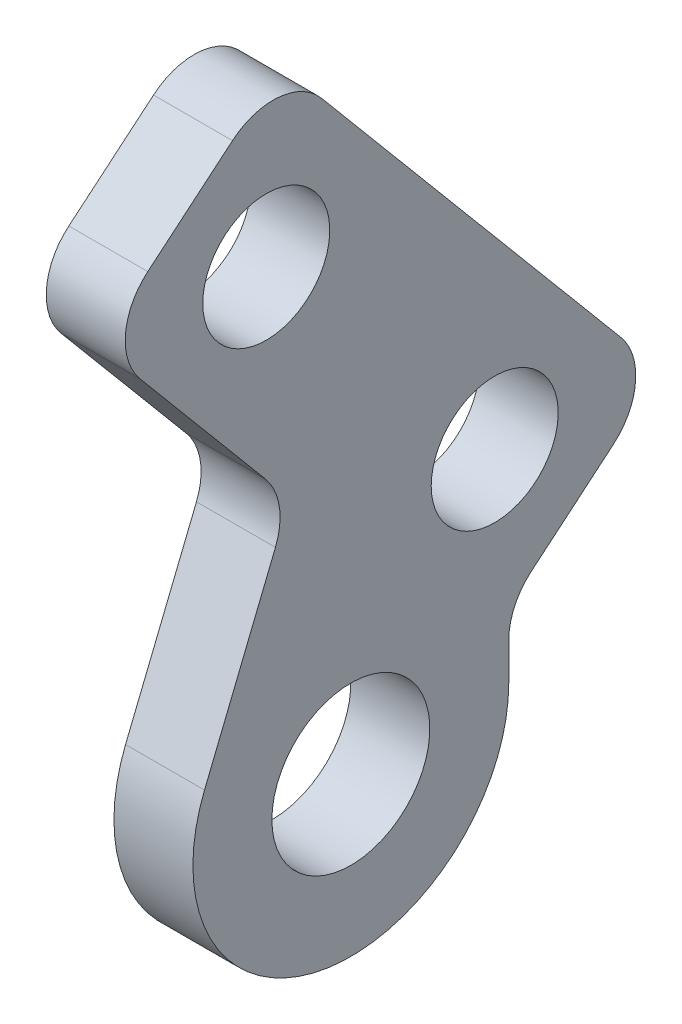
ISO-10303-21;
HEADER;
FILE_DESCRIPTION(('STEP AP214'),'2;1');
FILE_NAME('part.step','',(''),(''),'','','');
FILE_SCHEMA(('AUTOMOTIVE_DESIGN { 1 0 10303 214 1 1 1 1 }'));
ENDSEC;
DATA;
#1=APPLICATION_CONTEXT('core data for automotive mechanical design processes');
#2=APPLICATION_PROTOCOL_DEFINITION('international standard','automotive_design',2000,#1);
#3=PRODUCT_CONTEXT('',#1,'mechanical');
#4=PRODUCT('Part','Part','',(#3));
#5=PRODUCT_RELATED_PRODUCT_CATEGORY('part','',(#4));
#6=PRODUCT_DEFINITION_FORMATION('','',#4);
#7=PRODUCT_DEFINITION_CONTEXT('part definition',#1,'design');
#8=PRODUCT_DEFINITION('design','',#6,#7);
#9=PRODUCT_DEFINITION_SHAPE('','',#8);
#10=(LENGTH_UNIT() NAMED_UNIT(*) SI_UNIT(.MILLI.,.METRE.));
#11=(NAMED_UNIT(*) PLANE_ANGLE_UNIT() SI_UNIT($,.RADIAN.));
#12=(NAMED_UNIT(*) SI_UNIT($,.STERADIAN.) SOLID_ANGLE_UNIT());
#13=UNCERTAINTY_MEASURE_WITH_UNIT(LENGTH_MEASURE(1.E-05),#10,'distance_accuracy_value','');
#14=(GEOMETRIC_REPRESENTATION_CONTEXT(3) GLOBAL_UNCERTAINTY_ASSIGNED_CONTEXT((#13)) GLOBAL_UNIT_ASSIGNED_CONTEXT((#10,
#11,#12)) REPRESENTATION_CONTEXT('',''));
#15=CARTESIAN_POINT('',(0.,0.,0.));
#16=DIRECTION('',(0.,0.,1.));
#17=DIRECTION('',(1.,0.,0.));
#18=AXIS2_PLACEMENT_3D('',#15,#16,#17);
#19=CARTESIAN_POINT('',(-1.5875,9.52500000000001,-176.47164647412));
#20=DIRECTION('',(-1.,0.,0.));
#21=DIRECTION('',(0.,0.,1.));
#22=AXIS2_PLACEMENT_3D('',#19,#20,#21);
#23=PLANE('',#22);
#24=CARTESIAN_POINT('',(-1.58750000000001,9.52500000000001,-176.47164647412));
#25=DIRECTION('',(-1.,0.,0.));
#26=DIRECTION('',(0.,0.,1.));
#27=AXIS2_PLACEMENT_3D('',#24,#25,#26);
#28=CIRCLE('',#27,3.175);
#29=CARTESIAN_POINT('',(-1.58750000000001,9.52500000000001,-173.29664647412));
#30=VERTEX_POINT('',#29);
#31=EDGE_CURVE('E163',#30,#30,#28,.T.);
#32=ORIENTED_EDGE('',*,*,#31,.F.);
#33=EDGE_LOOP('',(#32));
#34=FACE_BOUND('',#33,.T.);
#35=CARTESIAN_POINT('',(-1.5875,28.8892429303716,-173.071588618471));
#36=DIRECTION('',(-1.,0.,0.));
#37=DIRECTION('',(0.,0.,1.));
#38=AXIS2_PLACEMENT_3D('',#35,#36,#37);
#39=CIRCLE('',#38,2.55269999999998);
#40=CARTESIAN_POINT('',(-1.5875,28.8892429303716,-170.518888618471));
#41=VERTEX_POINT('',#40);
#42=EDGE_CURVE('E223',#41,#41,#39,.T.);
#43=ORIENTED_EDGE('',*,*,#42,.F.);
#44=EDGE_LOOP('',(#43));
#45=FACE_BOUND('',#44,.T.);
#46=DIRECTION('',(0.,0.766044443118974,0.642787609686545));
#47=VECTOR('',#46,1.);
#48=CARTESIAN_POINT('',(-1.5875,81.5666029531743,-122.653033036499));
#49=LINE('',#48,#47);
#50=CARTESIAN_POINT('',(-1.5875,21.5268788651857,-173.032343374717));
#51=VERTEX_POINT('',#50);
#52=CARTESIAN_POINT('',(-1.5875,27.5305007140713,-167.994706495589));
#53=VERTEX_POINT('',#52);
#54=EDGE_CURVE('E138',#51,#53,#49,.T.);
#55=ORIENTED_EDGE('',*,*,#54,.T.);
#56=CARTESIAN_POINT('',(-1.5875,29.1631812426751,-169.940459381111));
#57=DIRECTION('',(-1.,0.,0.));
#58=DIRECTION('',(0.,0.,1.));
#59=AXIS2_PLACEMENT_3D('',#56,#57,#58);
#60=CIRCLE('',#59,2.54);
#61=CARTESIAN_POINT('',(-1.5875,31.1089341281973,-168.307778852507));
#62=VERTEX_POINT('',#61);
#63=EDGE_CURVE('E183',#53,#62,#60,.T.);
#64=ORIENTED_EDGE('',*,*,#63,.T.);
#65=DIRECTION('',(0.,0.642787609686545,-0.766044443118973));
#66=VECTOR('',#65,1.);
#67=CARTESIAN_POINT('',(-1.5875,30.4596506464192,-167.533992930486));
#68=LINE('',#67,#66);
#69=CARTESIAN_POINT('',(-1.5875,33.966125053254,-171.712846402171));
#70=VERTEX_POINT('',#69);
#71=EDGE_CURVE('E244',#62,#70,#68,.T.);
#72=ORIENTED_EDGE('',*,*,#71,.T.);
#73=CARTESIAN_POINT('',(-1.5875,32.0203721677318,-173.345526930775));
#74=DIRECTION('',(-1.,0.,0.));
#75=DIRECTION('',(0.,0.,1.));
#76=AXIS2_PLACEMENT_3D('',#73,#74,#75);
#77=CIRCLE('',#76,2.54);
#78=CARTESIAN_POINT('',(-1.5875,33.6530526963356,-175.291279816297));
#79=VERTEX_POINT('',#78);
#80=EDGE_CURVE('E181',#70,#79,#77,.T.);
#81=ORIENTED_EDGE('',*,*,#80,.T.);
#82=DIRECTION('',(0.,-0.766044443118974,-0.642787609686544));
#83=VECTOR('',#82,1.);
#84=CARTESIAN_POINT('',(-1.5875,87.6891549354387,-129.949606357207));
#85=LINE('',#84,#83);
#86=CARTESIAN_POINT('',(-1.5875,19.3031251656094,-187.33229871475));
#87=VERTEX_POINT('',#86);
#88=EDGE_CURVE('E217',#79,#87,#85,.T.);
#89=ORIENTED_EDGE('',*,*,#88,.T.);
#90=CARTESIAN_POINT('',(-1.5875,17.6704446370056,-185.386545829228));
#91=DIRECTION('',(-1.,0.,0.));
#92=DIRECTION('',(0.,0.,1.));
#93=AXIS2_PLACEMENT_3D('',#90,#91,#92);
#94=CIRCLE('',#93,2.54);
#95=CARTESIAN_POINT('',(-1.5875,15.7246917514834,-187.019226357832));
#96=VERTEX_POINT('',#95);
#97=EDGE_CURVE('E179',#87,#96,#94,.T.);
#98=ORIENTED_EDGE('',*,*,#97,.T.);
#99=DIRECTION('',(0.,-0.642787609686544,0.766044443118974));
#100=VECTOR('',#99,1.);
#101=CARTESIAN_POINT('',(-1.5875,12.2182173446486,-182.840372886147));
#102=LINE('',#101,#100);
#103=CARTESIAN_POINT('',(-1.5875,12.9638354530325,-183.728965945517));
#104=VERTEX_POINT('',#103);
#105=EDGE_CURVE('E215',#96,#104,#102,.T.);
#106=ORIENTED_EDGE('',*,*,#105,.T.);
#107=CARTESIAN_POINT('',(-1.5875,11.0180825675103,-185.36164647412));
#108=DIRECTION('',(-1.,0.,0.));
#109=DIRECTION('',(0.,0.,1.));
#110=AXIS2_PLACEMENT_3D('',#107,#108,#109);
#111=CIRCLE('',#110,2.54);
#112=CARTESIAN_POINT('',(-1.5875,11.0180825675103,-182.82164647412));
#113=VERTEX_POINT('',#112);
#114=EDGE_CURVE('E11',#104,#113,#111,.F.);
#115=ORIENTED_EDGE('',*,*,#114,.T.);
#116=DIRECTION('',(0.,-1.,0.));
#117=VECTOR('',#116,1.);
#118=CARTESIAN_POINT('',(-1.5875,82.55,-182.82164647412));
#119=LINE('',#118,#117);
#120=CARTESIAN_POINT('',(-1.5875,9.52500000000001,-182.82164647412));
#121=VERTEX_POINT('',#120);
#122=EDGE_CURVE('E144',#113,#121,#119,.T.);
#123=ORIENTED_EDGE('',*,*,#122,.T.);
#124=CARTESIAN_POINT('',(-1.5875,9.52500000000001,-176.47164647412));
#125=DIRECTION('',(-1.,0.,0.));
#126=DIRECTION('',(0.,0.,1.));
#127=AXIS2_PLACEMENT_3D('',#124,#125,#126);
#128=CIRCLE('',#127,6.34999999999999);
#129=CARTESIAN_POINT('',(-1.5875,11.9135952794059,-170.588015572101));
#130=VERTEX_POINT('',#129);
#131=EDGE_CURVE('E139',#121,#130,#128,.T.);
#132=ORIENTED_EDGE('',*,*,#131,.T.);
#133=DIRECTION('',(0.,0.926556047562137,-0.376156736914323));
#134=VECTOR('',#133,1.);
#135=CARTESIAN_POINT('',(-1.5875,56.2570524500952,-188.590261843887));
#136=LINE('',#135,#134);
#137=CARTESIAN_POINT('',(-1.5875,18.9387602248195,-173.440042850002));
#138=VERTEX_POINT('',#137);
#139=EDGE_CURVE('E128',#130,#138,#136,.T.);
#140=ORIENTED_EDGE('',*,*,#139,.T.);
#141=CARTESIAN_POINT('',(-1.5875,19.8941983365819,-171.086590489194));
#142=DIRECTION('',(-1.,0.,0.));
#143=DIRECTION('',(0.,0.,1.));
#144=AXIS2_PLACEMENT_3D('',#141,#142,#143);
#145=CIRCLE('',#144,2.54);
#146=EDGE_CURVE('E199',#138,#51,#145,.F.);
#147=ORIENTED_EDGE('',*,*,#146,.T.);
#148=EDGE_LOOP('',(#55,#64,#72,#81,#89,#98,#106,#115,#123,#132,#140,#147));
#149=FACE_BOUND('',#148,.T.);
#150=CARTESIAN_POINT('',(-1.5875,17.9443829493092,-182.255416591868));
#151=DIRECTION('',(-1.,0.,0.));
#152=DIRECTION('',(0.,0.,1.));
#153=AXIS2_PLACEMENT_3D('',#150,#151,#152);
#154=CIRCLE('',#153,2.55270000000004);
#155=CARTESIAN_POINT('',(-1.5875,17.9443829493092,-179.702716591868));
#156=VERTEX_POINT('',#155);
#157=EDGE_CURVE('E251',#156,#156,#154,.T.);
#158=ORIENTED_EDGE('',*,*,#157,.F.);
#159=EDGE_LOOP('',(#158));
#160=FACE_BOUND('',#159,.T.);
#161=ADVANCED_FACE('F39',(#34,#45,#149,#160),#23,.T.);
#162=CARTESIAN_POINT('',(1.5875,9.52500000000001,-176.47164647412));
#163=DIRECTION('',(-1.,0.,0.));
#164=DIRECTION('',(0.,0.,1.));
#165=AXIS2_PLACEMENT_3D('',#162,#163,#164);
#166=PLANE('',#165);
#167=CARTESIAN_POINT('',(1.5875,9.52500000000001,-176.47164647412));
#168=DIRECTION('',(-1.,0.,0.));
#169=DIRECTION('',(0.,0.,1.));
#170=AXIS2_PLACEMENT_3D('',#167,#168,#169);
#171=CIRCLE('',#170,3.175);
#172=CARTESIAN_POINT('',(1.5875,9.52500000000001,-173.29664647412));
#173=VERTEX_POINT('',#172);
#174=EDGE_CURVE('E161',#173,#173,#171,.T.);
#175=ORIENTED_EDGE('',*,*,#174,.T.);
#176=EDGE_LOOP('',(#175));
#177=FACE_BOUND('',#176,.T.);
#178=DIRECTION('',(0.,0.642787609686545,-0.766044443118973));
#179=VECTOR('',#178,1.);
#180=CARTESIAN_POINT('',(1.5875,30.4596506464192,-167.533992930486));
#181=LINE('',#180,#179);
#182=CARTESIAN_POINT('',(1.5875,31.1089341281973,-168.307778852507));
#183=VERTEX_POINT('',#182);
#184=CARTESIAN_POINT('',(1.5875,33.966125053254,-171.712846402171));
#185=VERTEX_POINT('',#184);
#186=EDGE_CURVE('E228',#183,#185,#181,.T.);
#187=ORIENTED_EDGE('',*,*,#186,.F.);
#188=CARTESIAN_POINT('',(1.5875,29.1631812426751,-169.940459381111));
#189=DIRECTION('',(-1.,0.,0.));
#190=DIRECTION('',(0.,0.,1.));
#191=AXIS2_PLACEMENT_3D('',#188,#189,#190);
#192=CIRCLE('',#191,2.54);
#193=CARTESIAN_POINT('',(1.5875,27.5305007140713,-167.994706495589));
#194=VERTEX_POINT('',#193);
#195=EDGE_CURVE('E177',#183,#194,#192,.F.);
#196=ORIENTED_EDGE('',*,*,#195,.T.);
#197=DIRECTION('',(0.,0.766044443118974,0.642787609686545));
#198=VECTOR('',#197,1.);
#199=CARTESIAN_POINT('',(1.5875,81.5666029531743,-122.653033036499));
#200=LINE('',#199,#198);
#201=CARTESIAN_POINT('',(1.5875,21.5268788651857,-173.032343374717));
#202=VERTEX_POINT('',#201);
#203=EDGE_CURVE('E225',#202,#194,#200,.T.);
#204=ORIENTED_EDGE('',*,*,#203,.F.);
#205=CARTESIAN_POINT('',(1.5875,19.8941983365819,-171.086590489194));
#206=DIRECTION('',(-1.,0.,0.));
#207=DIRECTION('',(0.,0.,1.));
#208=AXIS2_PLACEMENT_3D('',#205,#206,#207);
#209=CIRCLE('',#208,2.54);
#210=CARTESIAN_POINT('',(1.5875,18.9387602248195,-173.440042850002));
#211=VERTEX_POINT('',#210);
#212=EDGE_CURVE('E197',#202,#211,#209,.T.);
#213=ORIENTED_EDGE('',*,*,#212,.T.);
#214=DIRECTION('',(0.,0.926556047562137,-0.376156736914323));
#215=VECTOR('',#214,1.);
#216=CARTESIAN_POINT('',(1.5875,56.2570524500952,-188.590261843887));
#217=LINE('',#216,#215);
#218=CARTESIAN_POINT('',(1.5875,11.9135952794059,-170.588015572101));
#219=VERTEX_POINT('',#218);
#220=EDGE_CURVE('E222',#219,#211,#217,.T.);
#221=ORIENTED_EDGE('',*,*,#220,.F.);
#222=CARTESIAN_POINT('',(1.5875,9.52500000000001,-176.47164647412));
#223=DIRECTION('',(-1.,0.,0.));
#224=DIRECTION('',(0.,0.,1.));
#225=AXIS2_PLACEMENT_3D('',#222,#223,#224);
#226=CIRCLE('',#225,6.34999999999999);
#227=CARTESIAN_POINT('',(1.5875,9.52500000000001,-182.82164647412));
#228=VERTEX_POINT('',#227);
#229=EDGE_CURVE('E152',#228,#219,#226,.T.);
#230=ORIENTED_EDGE('',*,*,#229,.F.);
#231=DIRECTION('',(0.,-1.,0.));
#232=VECTOR('',#231,1.);
#233=CARTESIAN_POINT('',(1.5875,82.55,-182.82164647412));
#234=LINE('',#233,#232);
#235=CARTESIAN_POINT('',(1.5875,11.0180825675103,-182.82164647412));
#236=VERTEX_POINT('',#235);
#237=EDGE_CURVE('E148',#236,#228,#234,.T.);
#238=ORIENTED_EDGE('',*,*,#237,.F.);
#239=CARTESIAN_POINT('',(1.5875,11.0180825675103,-185.36164647412));
#240=DIRECTION('',(-1.,0.,0.));
#241=DIRECTION('',(0.,0.,1.));
#242=AXIS2_PLACEMENT_3D('',#239,#240,#241);
#243=CIRCLE('',#242,2.54);
#244=CARTESIAN_POINT('',(1.5875,12.9638354530325,-183.728965945517));
#245=VERTEX_POINT('',#244);
#246=EDGE_CURVE('E47',#236,#245,#243,.T.);
#247=ORIENTED_EDGE('',*,*,#246,.T.);
#248=DIRECTION('',(0.,-0.642787609686544,0.766044443118974));
#249=VECTOR('',#248,1.);
#250=CARTESIAN_POINT('',(1.5875,12.2182173446486,-182.840372886147));
#251=LINE('',#250,#249);
#252=CARTESIAN_POINT('',(1.5875,15.7246917514834,-187.019226357832));
#253=VERTEX_POINT('',#252);
#254=EDGE_CURVE('E206',#253,#245,#251,.T.);
#255=ORIENTED_EDGE('',*,*,#254,.F.);
#256=CARTESIAN_POINT('',(1.5875,17.6704446370056,-185.386545829228));
#257=DIRECTION('',(-1.,0.,0.));
#258=DIRECTION('',(0.,0.,1.));
#259=AXIS2_PLACEMENT_3D('',#256,#257,#258);
#260=CIRCLE('',#259,2.54);
#261=CARTESIAN_POINT('',(1.5875,19.3031251656094,-187.33229871475));
#262=VERTEX_POINT('',#261);
#263=EDGE_CURVE('E173',#253,#262,#260,.F.);
#264=ORIENTED_EDGE('',*,*,#263,.T.);
#265=DIRECTION('',(0.,-0.766044443118974,-0.642787609686544));
#266=VECTOR('',#265,1.);
#267=CARTESIAN_POINT('',(1.5875,87.6891549354387,-129.949606357207));
#268=LINE('',#267,#266);
#269=CARTESIAN_POINT('',(1.5875,33.6530526963356,-175.291279816297));
#270=VERTEX_POINT('',#269);
#271=EDGE_CURVE('E211',#270,#262,#268,.T.);
#272=ORIENTED_EDGE('',*,*,#271,.F.);
#273=CARTESIAN_POINT('',(1.5875,32.0203721677318,-173.345526930775));
#274=DIRECTION('',(-1.,0.,0.));
#275=DIRECTION('',(0.,0.,1.));
#276=AXIS2_PLACEMENT_3D('',#273,#274,#275);
#277=CIRCLE('',#276,2.54);
#278=EDGE_CURVE('E175',#270,#185,#277,.F.);
#279=ORIENTED_EDGE('',*,*,#278,.T.);
#280=EDGE_LOOP('',(#187,#196,#204,#213,#221,#230,#238,#247,#255,#264,#272,#279));
#281=FACE_BOUND('',#280,.T.);
#282=CARTESIAN_POINT('',(1.5875,28.8892429303716,-173.071588618471));
#283=DIRECTION('',(-1.,0.,0.));
#284=DIRECTION('',(0.,0.,1.));
#285=AXIS2_PLACEMENT_3D('',#282,#283,#284);
#286=CIRCLE('',#285,2.55269999999998);
#287=CARTESIAN_POINT('',(1.5875,28.8892429303716,-170.518888618471));
#288=VERTEX_POINT('',#287);
#289=EDGE_CURVE('E248',#288,#288,#286,.T.);
#290=ORIENTED_EDGE('',*,*,#289,.T.);
#291=EDGE_LOOP('',(#290));
#292=FACE_BOUND('',#291,.T.);
#293=CARTESIAN_POINT('',(1.5875,17.9443829493092,-182.255416591868));
#294=DIRECTION('',(-1.,0.,0.));
#295=DIRECTION('',(0.,0.,1.));
#296=AXIS2_PLACEMENT_3D('',#293,#294,#295);
#297=CIRCLE('',#296,2.55270000000004);
#298=CARTESIAN_POINT('',(1.5875,17.9443829493092,-179.702716591868));
#299=VERTEX_POINT('',#298);
#300=EDGE_CURVE('E254',#299,#299,#297,.T.);
#301=ORIENTED_EDGE('',*,*,#300,.T.);
#302=EDGE_LOOP('',(#301));
#303=FACE_BOUND('',#302,.T.);
#304=ADVANCED_FACE('F204',(#177,#281,#292,#303),#166,.F.);
#305=CARTESIAN_POINT('',(-1.5875,9.52500000000001,-176.47164647412));
#306=DIRECTION('',(1.,0.,0.));
#307=DIRECTION('',(0.,0.,-1.));
#308=AXIS2_PLACEMENT_3D('',#305,#306,#307);
#309=CYLINDRICAL_SURFACE('',#308,6.34999999999999);
#310=ORIENTED_EDGE('',*,*,#229,.T.);
#311=DIRECTION('',(1.,0.,0.));
#312=VECTOR('',#311,1.);
#313=CARTESIAN_POINT('',(-1.5875,11.9135952794059,-170.588015572101));
#314=LINE('',#313,#312);
#315=EDGE_CURVE('E133',#130,#219,#314,.T.);
#316=ORIENTED_EDGE('',*,*,#315,.F.);
#317=ORIENTED_EDGE('',*,*,#131,.F.);
#318=DIRECTION('',(1.,0.,0.));
#319=VECTOR('',#318,1.);
#320=CARTESIAN_POINT('',(-1.5875,9.52500000000001,-182.82164647412));
#321=LINE('',#320,#319);
#322=EDGE_CURVE('E154',#121,#228,#321,.T.);
#323=ORIENTED_EDGE('',*,*,#322,.T.);
#324=EDGE_LOOP('',(#310,#316,#317,#323));
#325=FACE_BOUND('',#324,.T.);
#326=ADVANCED_FACE('F150',(#325),#309,.T.);
#327=CARTESIAN_POINT('',(-1.5875,56.2570524500952,-188.590261843887));
#328=DIRECTION('',(0.,-0.376156736914323,-0.926556047562137));
#329=DIRECTION('',(0.,0.926556047562137,-0.376156736914323));
#330=AXIS2_PLACEMENT_3D('',#327,#328,#329);
#331=PLANE('',#330);
#332=ORIENTED_EDGE('',*,*,#220,.T.);
#333=DIRECTION('',(1.,0.,0.));
#334=VECTOR('',#333,1.);
#335=CARTESIAN_POINT('',(-1.5875,18.9387602248195,-173.440042850002));
#336=LINE('',#335,#334);
#337=EDGE_CURVE('E136',#211,#138,#336,.F.);
#338=ORIENTED_EDGE('',*,*,#337,.T.);
#339=ORIENTED_EDGE('',*,*,#139,.F.);
#340=ORIENTED_EDGE('',*,*,#315,.T.);
#341=EDGE_LOOP('',(#332,#338,#339,#340));
#342=FACE_BOUND('',#341,.T.);
#343=ADVANCED_FACE('F131',(#342),#331,.F.);
#344=CARTESIAN_POINT('',(-1.5875,81.5666029531743,-122.653033036499));
#345=DIRECTION('',(0.,0.642787609686545,-0.766044443118973));
#346=DIRECTION('',(0.,0.766044443118974,0.642787609686545));
#347=AXIS2_PLACEMENT_3D('',#344,#345,#346);
#348=PLANE('',#347);
#349=ORIENTED_EDGE('',*,*,#54,.F.);
#350=DIRECTION('',(1.,0.,0.));
#351=VECTOR('',#350,1.);
#352=CARTESIAN_POINT('',(1.5875,21.5268788651857,-173.032343374717));
#353=LINE('',#352,#351);
#354=EDGE_CURVE('E156',#51,#202,#353,.T.);
#355=ORIENTED_EDGE('',*,*,#354,.T.);
#356=ORIENTED_EDGE('',*,*,#203,.T.);
#357=DIRECTION('',(1.,0.,0.));
#358=VECTOR('',#357,1.);
#359=CARTESIAN_POINT('',(-1.5875,27.5305007140713,-167.994706495589));
#360=LINE('',#359,#358);
#361=EDGE_CURVE('E153',#194,#53,#360,.F.);
#362=ORIENTED_EDGE('',*,*,#361,.T.);
#363=EDGE_LOOP('',(#349,#355,#356,#362));
#364=FACE_BOUND('',#363,.T.);
#365=ADVANCED_FACE('F300',(#364),#348,.F.);
#366=CARTESIAN_POINT('',(-1.5875,30.4596506464192,-167.533992930486));
#367=DIRECTION('',(0.,-0.766044443118973,-0.642787609686545));
#368=DIRECTION('',(0.,0.642787609686545,-0.766044443118973));
#369=AXIS2_PLACEMENT_3D('',#366,#367,#368);
#370=PLANE('',#369);
#371=ORIENTED_EDGE('',*,*,#71,.F.);
#372=DIRECTION('',(1.,0.,0.));
#373=VECTOR('',#372,1.);
#374=CARTESIAN_POINT('',(-1.5875,31.1089341281973,-168.307778852507));
#375=LINE('',#374,#373);
#376=EDGE_CURVE('E170',#62,#183,#375,.T.);
#377=ORIENTED_EDGE('',*,*,#376,.T.);
#378=ORIENTED_EDGE('',*,*,#186,.T.);
#379=DIRECTION('',(1.,0.,0.));
#380=VECTOR('',#379,1.);
#381=CARTESIAN_POINT('',(-1.5875,33.966125053254,-171.712846402171));
#382=LINE('',#381,#380);
#383=EDGE_CURVE('E168',#185,#70,#382,.F.);
#384=ORIENTED_EDGE('',*,*,#383,.T.);
#385=EDGE_LOOP('',(#371,#377,#378,#384));
#386=FACE_BOUND('',#385,.T.);
#387=ADVANCED_FACE('F297',(#386),#370,.F.);
#388=CARTESIAN_POINT('',(-1.5875,87.6891549354387,-129.949606357207));
#389=DIRECTION('',(0.,-0.642787609686544,0.766044443118974));
#390=DIRECTION('',(0.,-0.766044443118974,-0.642787609686544));
#391=AXIS2_PLACEMENT_3D('',#388,#389,#390);
#392=PLANE('',#391);
#393=ORIENTED_EDGE('',*,*,#88,.F.);
#394=DIRECTION('',(1.,0.,0.));
#395=VECTOR('',#394,1.);
#396=CARTESIAN_POINT('',(-1.5875,33.6530526963356,-175.291279816297));
#397=LINE('',#396,#395);
#398=EDGE_CURVE('E187',#79,#270,#397,.T.);
#399=ORIENTED_EDGE('',*,*,#398,.T.);
#400=ORIENTED_EDGE('',*,*,#271,.T.);
#401=DIRECTION('',(1.,0.,0.));
#402=VECTOR('',#401,1.);
#403=CARTESIAN_POINT('',(-1.5875,19.3031251656095,-187.33229871475));
#404=LINE('',#403,#402);
#405=EDGE_CURVE('E185',#262,#87,#404,.F.);
#406=ORIENTED_EDGE('',*,*,#405,.T.);
#407=EDGE_LOOP('',(#393,#399,#400,#406));
#408=FACE_BOUND('',#407,.T.);
#409=ADVANCED_FACE('F236',(#408),#392,.F.);
#410=CARTESIAN_POINT('',(-1.5875,12.2182173446486,-182.840372886147));
#411=DIRECTION('',(0.,0.766044443118974,0.642787609686544));
#412=DIRECTION('',(0.,-0.642787609686544,0.766044443118974));
#413=AXIS2_PLACEMENT_3D('',#410,#411,#412);
#414=PLANE('',#413);
#415=ORIENTED_EDGE('',*,*,#105,.F.);
#416=DIRECTION('',(1.,0.,0.));
#417=VECTOR('',#416,1.);
#418=CARTESIAN_POINT('',(-1.5875,15.7246917514834,-187.019226357832));
#419=LINE('',#418,#417);
#420=EDGE_CURVE('E191',#96,#253,#419,.T.);
#421=ORIENTED_EDGE('',*,*,#420,.T.);
#422=ORIENTED_EDGE('',*,*,#254,.T.);
#423=DIRECTION('',(1.,0.,0.));
#424=VECTOR('',#423,1.);
#425=CARTESIAN_POINT('',(-1.5875,12.9638354530325,-183.728965945517));
#426=LINE('',#425,#424);
#427=EDGE_CURVE('E60',#245,#104,#426,.F.);
#428=ORIENTED_EDGE('',*,*,#427,.T.);
#429=EDGE_LOOP('',(#415,#421,#422,#428));
#430=FACE_BOUND('',#429,.T.);
#431=ADVANCED_FACE('F209',(#430),#414,.F.);
#432=CARTESIAN_POINT('',(-1.5875,82.55,-182.82164647412));
#433=DIRECTION('',(0.,0.,1.));
#434=DIRECTION('',(1.,0.,0.));
#435=AXIS2_PLACEMENT_3D('',#432,#433,#434);
#436=PLANE('',#435);
#437=ORIENTED_EDGE('',*,*,#122,.F.);
#438=DIRECTION('',(1.,0.,0.));
#439=VECTOR('',#438,1.);
#440=CARTESIAN_POINT('',(1.5875,11.0180825675103,-182.82164647412));
#441=LINE('',#440,#439);
#442=EDGE_CURVE('E194',#113,#236,#441,.T.);
#443=ORIENTED_EDGE('',*,*,#442,.T.);
#444=ORIENTED_EDGE('',*,*,#237,.T.);
#445=ORIENTED_EDGE('',*,*,#322,.F.);
#446=EDGE_LOOP('',(#437,#443,#444,#445));
#447=FACE_BOUND('',#446,.T.);
#448=ADVANCED_FACE('F214',(#447),#436,.F.);
#449=CARTESIAN_POINT('',(-1.5875,28.8892429303716,-173.071588618471));
#450=DIRECTION('',(1.,0.,0.));
#451=DIRECTION('',(0.,0.,-1.));
#452=AXIS2_PLACEMENT_3D('',#449,#450,#451);
#453=CYLINDRICAL_SURFACE('',#452,2.55269999999998);
#454=ORIENTED_EDGE('',*,*,#42,.T.);
#455=EDGE_LOOP('',(#454));
#456=FACE_BOUND('',#455,.T.);
#457=ORIENTED_EDGE('',*,*,#289,.F.);
#458=EDGE_LOOP('',(#457));
#459=FACE_BOUND('',#458,.T.);
#460=ADVANCED_FACE('F270',(#456,#459),#453,.F.);
#461=CARTESIAN_POINT('',(-1.5875,17.9443829493092,-182.255416591868));
#462=DIRECTION('',(1.,0.,0.));
#463=DIRECTION('',(0.,0.,-1.));
#464=AXIS2_PLACEMENT_3D('',#461,#462,#463);
#465=CYLINDRICAL_SURFACE('',#464,2.55270000000004);
#466=ORIENTED_EDGE('',*,*,#157,.T.);
#467=EDGE_LOOP('',(#466));
#468=FACE_BOUND('',#467,.T.);
#469=ORIENTED_EDGE('',*,*,#300,.F.);
#470=EDGE_LOOP('',(#469));
#471=FACE_BOUND('',#470,.T.);
#472=ADVANCED_FACE('F273',(#468,#471),#465,.F.);
#473=CARTESIAN_POINT('',(240.9346312661,9.52500000000001,-176.47164647412));
#474=DIRECTION('',(-1.,0.,0.));
#475=DIRECTION('',(0.,0.,1.));
#476=AXIS2_PLACEMENT_3D('',#473,#474,#475);
#477=CYLINDRICAL_SURFACE('',#476,3.175);
#478=ORIENTED_EDGE('',*,*,#31,.T.);
#479=EDGE_LOOP('',(#478));
#480=FACE_BOUND('',#479,.T.);
#481=ORIENTED_EDGE('',*,*,#174,.F.);
#482=EDGE_LOOP('',(#481));
#483=FACE_BOUND('',#482,.T.);
#484=ADVANCED_FACE('F262',(#480,#483),#477,.F.);
#485=CARTESIAN_POINT('',(-1.5875,19.8941983365819,-171.086590489194));
#486=DIRECTION('',(-1.,0.,0.));
#487=DIRECTION('',(0.,0.,1.));
#488=AXIS2_PLACEMENT_3D('',#485,#486,#487);
#489=CYLINDRICAL_SURFACE('',#488,2.54);
#490=ORIENTED_EDGE('',*,*,#146,.F.);
#491=ORIENTED_EDGE('',*,*,#337,.F.);
#492=ORIENTED_EDGE('',*,*,#212,.F.);
#493=ORIENTED_EDGE('',*,*,#354,.F.);
#494=EDGE_LOOP('',(#490,#491,#492,#493));
#495=FACE_BOUND('',#494,.T.);
#496=ADVANCED_FACE('F288',(#495),#489,.F.);
#497=CARTESIAN_POINT('',(-1.5875,29.1631812426751,-169.940459381111));
#498=DIRECTION('',(1.,0.,0.));
#499=DIRECTION('',(0.,0.,-1.));
#500=AXIS2_PLACEMENT_3D('',#497,#498,#499);
#501=CYLINDRICAL_SURFACE('',#500,2.54);
#502=ORIENTED_EDGE('',*,*,#63,.F.);
#503=ORIENTED_EDGE('',*,*,#361,.F.);
#504=ORIENTED_EDGE('',*,*,#195,.F.);
#505=ORIENTED_EDGE('',*,*,#376,.F.);
#506=EDGE_LOOP('',(#502,#503,#504,#505));
#507=FACE_BOUND('',#506,.T.);
#508=ADVANCED_FACE('F311',(#507),#501,.T.);
#509=CARTESIAN_POINT('',(-1.5875,32.0203721677318,-173.345526930775));
#510=DIRECTION('',(1.,0.,0.));
#511=DIRECTION('',(0.,0.,-1.));
#512=AXIS2_PLACEMENT_3D('',#509,#510,#511);
#513=CYLINDRICAL_SURFACE('',#512,2.54);
#514=ORIENTED_EDGE('',*,*,#80,.F.);
#515=ORIENTED_EDGE('',*,*,#383,.F.);
#516=ORIENTED_EDGE('',*,*,#278,.F.);
#517=ORIENTED_EDGE('',*,*,#398,.F.);
#518=EDGE_LOOP('',(#514,#515,#516,#517));
#519=FACE_BOUND('',#518,.T.);
#520=ADVANCED_FACE('F315',(#519),#513,.T.);
#521=CARTESIAN_POINT('',(-1.5875,17.6704446370056,-185.386545829228));
#522=DIRECTION('',(1.,0.,0.));
#523=DIRECTION('',(0.,0.,-1.));
#524=AXIS2_PLACEMENT_3D('',#521,#522,#523);
#525=CYLINDRICAL_SURFACE('',#524,2.54);
#526=ORIENTED_EDGE('',*,*,#97,.F.);
#527=ORIENTED_EDGE('',*,*,#405,.F.);
#528=ORIENTED_EDGE('',*,*,#263,.F.);
#529=ORIENTED_EDGE('',*,*,#420,.F.);
#530=EDGE_LOOP('',(#526,#527,#528,#529));
#531=FACE_BOUND('',#530,.T.);
#532=ADVANCED_FACE('F241',(#531),#525,.T.);
#533=CARTESIAN_POINT('',(-1.5875,11.0180825675103,-185.36164647412));
#534=DIRECTION('',(-1.,0.,0.));
#535=DIRECTION('',(0.,0.,1.));
#536=AXIS2_PLACEMENT_3D('',#533,#534,#535);
#537=CYLINDRICAL_SURFACE('',#536,2.54);
#538=ORIENTED_EDGE('',*,*,#114,.F.);
#539=ORIENTED_EDGE('',*,*,#427,.F.);
#540=ORIENTED_EDGE('',*,*,#246,.F.);
#541=ORIENTED_EDGE('',*,*,#442,.F.);
#542=EDGE_LOOP('',(#538,#539,#540,#541));
#543=FACE_BOUND('',#542,.T.);
#544=ADVANCED_FACE('F41',(#543),#537,.F.);
#545=CLOSED_SHELL('',(#161,#304,#326,#343,#365,#387,#409,#431,#448,#460,#472,#484,#496,#508,
#520,#532,#544));
#546=MANIFOLD_SOLID_BREP('B2',#545);
#547=ADVANCED_BREP_SHAPE_REPRESENTATION('',(#18,#546),#14);
#548=SHAPE_DEFINITION_REPRESENTATION(#9,#547);
ENDSEC;
END-ISO-10303-21;
